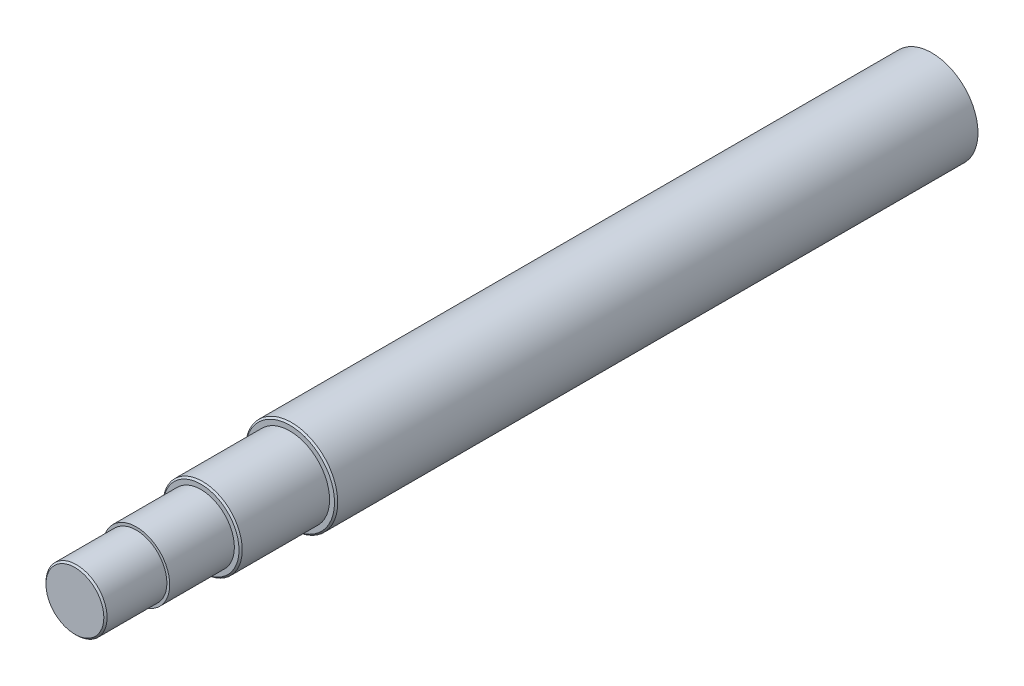
ISO-10303-21;
HEADER;
FILE_DESCRIPTION(('STEP AP214'),'2;1');
FILE_NAME('part.step','',(''),(''),'','','');
FILE_SCHEMA(('AUTOMOTIVE_DESIGN { 1 0 10303 214 1 1 1 1 }'));
ENDSEC;
DATA;
#1=APPLICATION_CONTEXT('core data for automotive mechanical design processes');
#2=APPLICATION_PROTOCOL_DEFINITION('international standard','automotive_design',2000,#1);
#3=PRODUCT_CONTEXT('',#1,'mechanical');
#4=PRODUCT('Part','Part','',(#3));
#5=PRODUCT_RELATED_PRODUCT_CATEGORY('part','',(#4));
#6=PRODUCT_DEFINITION_FORMATION('','',#4);
#7=PRODUCT_DEFINITION_CONTEXT('part definition',#1,'design');
#8=PRODUCT_DEFINITION('design','',#6,#7);
#9=PRODUCT_DEFINITION_SHAPE('','',#8);
#10=(LENGTH_UNIT() NAMED_UNIT(*) SI_UNIT(.MILLI.,.METRE.));
#11=(NAMED_UNIT(*) PLANE_ANGLE_UNIT() SI_UNIT($,.RADIAN.));
#12=(NAMED_UNIT(*) SI_UNIT($,.STERADIAN.) SOLID_ANGLE_UNIT());
#13=UNCERTAINTY_MEASURE_WITH_UNIT(LENGTH_MEASURE(1.E-05),#10,'distance_accuracy_value','');
#14=(GEOMETRIC_REPRESENTATION_CONTEXT(3) GLOBAL_UNCERTAINTY_ASSIGNED_CONTEXT((#13)) GLOBAL_UNIT_ASSIGNED_CONTEXT((#10,
#11,#12)) REPRESENTATION_CONTEXT('',''));
#15=CARTESIAN_POINT('',(0.,0.,0.));
#16=DIRECTION('',(0.,0.,1.));
#17=DIRECTION('',(1.,0.,0.));
#18=AXIS2_PLACEMENT_3D('',#15,#16,#17);
#19=CARTESIAN_POINT('',(0.,0.,452.));
#20=DIRECTION('',(0.,0.,1.));
#21=DIRECTION('',(1.,0.,0.));
#22=AXIS2_PLACEMENT_3D('',#19,#20,#21);
#23=PLANE('',#22);
#24=CARTESIAN_POINT('',(0.,0.,452.));
#25=DIRECTION('',(0.,0.,1.));
#26=DIRECTION('',(1.,0.,0.));
#27=AXIS2_PLACEMENT_3D('',#24,#25,#26);
#28=CIRCLE('',#27,23.5);
#29=CARTESIAN_POINT('',(23.5,0.,452.));
#30=VERTEX_POINT('',#29);
#31=EDGE_CURVE('E50',#30,#30,#28,.T.);
#32=ORIENTED_EDGE('',*,*,#31,.T.);
#33=EDGE_LOOP('',(#32));
#34=FACE_BOUND('',#33,.T.);
#35=CARTESIAN_POINT('',(0.,0.,452.));
#36=DIRECTION('',(0.,0.,1.));
#37=DIRECTION('',(1.,0.,0.));
#38=AXIS2_PLACEMENT_3D('',#35,#36,#37);
#39=CIRCLE('',#38,20.64);
#40=CARTESIAN_POINT('',(20.64,0.,452.));
#41=VERTEX_POINT('',#40);
#42=EDGE_CURVE('E68',#41,#41,#39,.T.);
#43=ORIENTED_EDGE('',*,*,#42,.F.);
#44=EDGE_LOOP('',(#43));
#45=FACE_BOUND('',#44,.T.);
#46=ADVANCED_FACE('F35',(#34,#45),#23,.T.);
#47=CARTESIAN_POINT('',(0.,0.,492.));
#48=DIRECTION('',(0.,0.,1.));
#49=DIRECTION('',(1.,0.,0.));
#50=AXIS2_PLACEMENT_3D('',#47,#48,#49);
#51=PLANE('',#50);
#52=CARTESIAN_POINT('',(0.,0.,492.));
#53=DIRECTION('',(0.,0.,1.));
#54=DIRECTION('',(1.,0.,0.));
#55=AXIS2_PLACEMENT_3D('',#52,#53,#54);
#56=CIRCLE('',#55,18.9);
#57=CARTESIAN_POINT('',(18.9,0.,492.));
#58=VERTEX_POINT('',#57);
#59=EDGE_CURVE('E65',#58,#58,#56,.T.);
#60=ORIENTED_EDGE('',*,*,#59,.F.);
#61=EDGE_LOOP('',(#60));
#62=FACE_BOUND('',#61,.T.);
#63=CARTESIAN_POINT('',(0.,0.,492.));
#64=DIRECTION('',(0.,0.,1.));
#65=DIRECTION('',(1.,0.,0.));
#66=AXIS2_PLACEMENT_3D('',#63,#64,#65);
#67=CIRCLE('',#66,20.64);
#68=CARTESIAN_POINT('',(20.64,0.,492.));
#69=VERTEX_POINT('',#68);
#70=EDGE_CURVE('E69',#69,#69,#67,.T.);
#71=ORIENTED_EDGE('',*,*,#70,.T.);
#72=EDGE_LOOP('',(#71));
#73=FACE_BOUND('',#72,.T.);
#74=ADVANCED_FACE('F106',(#62,#73),#51,.T.);
#75=CARTESIAN_POINT('',(0.,0.,492.));
#76=DIRECTION('',(0.,0.,1.));
#77=DIRECTION('',(1.,0.,0.));
#78=AXIS2_PLACEMENT_3D('',#75,#76,#77);
#79=CYLINDRICAL_SURFACE('',#78,18.9);
#80=CARTESIAN_POINT('',(0.,0.,529.));
#81=DIRECTION('',(0.,0.,1.));
#82=DIRECTION('',(1.,0.,0.));
#83=AXIS2_PLACEMENT_3D('',#80,#81,#82);
#84=CIRCLE('',#83,18.9);
#85=CARTESIAN_POINT('',(18.9,0.,529.));
#86=VERTEX_POINT('',#85);
#87=EDGE_CURVE('E11',#86,#86,#84,.F.);
#88=ORIENTED_EDGE('',*,*,#87,.T.);
#89=EDGE_LOOP('',(#88));
#90=FACE_BOUND('',#89,.T.);
#91=ORIENTED_EDGE('',*,*,#59,.T.);
#92=EDGE_LOOP('',(#91));
#93=FACE_BOUND('',#92,.T.);
#94=ADVANCED_FACE('F112',(#90,#93),#79,.T.);
#95=CARTESIAN_POINT('',(0.,0.,530.));
#96=DIRECTION('',(0.,0.,1.));
#97=DIRECTION('',(1.,0.,0.));
#98=AXIS2_PLACEMENT_3D('',#95,#96,#97);
#99=PLANE('',#98);
#100=CARTESIAN_POINT('',(0.,0.,530.));
#101=DIRECTION('',(0.,0.,1.));
#102=DIRECTION('',(1.,0.,0.));
#103=AXIS2_PLACEMENT_3D('',#100,#101,#102);
#104=CIRCLE('',#103,17.8999999999999);
#105=CARTESIAN_POINT('',(17.8999999999999,0.,530.));
#106=VERTEX_POINT('',#105);
#107=EDGE_CURVE('E42',#106,#106,#104,.T.);
#108=ORIENTED_EDGE('',*,*,#107,.T.);
#109=EDGE_LOOP('',(#108));
#110=FACE_BOUND('',#109,.T.);
#111=ADVANCED_FACE('F121',(#110),#99,.T.);
#112=CARTESIAN_POINT('',(0.,0.,452.));
#113=DIRECTION('',(0.,0.,1.));
#114=DIRECTION('',(1.,0.,0.));
#115=AXIS2_PLACEMENT_3D('',#112,#113,#114);
#116=CYLINDRICAL_SURFACE('',#115,20.64);
#117=ORIENTED_EDGE('',*,*,#42,.T.);
#118=EDGE_LOOP('',(#117));
#119=FACE_BOUND('',#118,.T.);
#120=ORIENTED_EDGE('',*,*,#70,.F.);
#121=EDGE_LOOP('',(#120));
#122=FACE_BOUND('',#121,.T.);
#123=ADVANCED_FACE('F118',(#119,#122),#116,.T.);
#124=CARTESIAN_POINT('',(0.,0.,397.));
#125=DIRECTION('',(0.,0.,1.));
#126=DIRECTION('',(1.,0.,0.));
#127=AXIS2_PLACEMENT_3D('',#124,#125,#126);
#128=PLANE('',#127);
#129=CARTESIAN_POINT('',(0.,0.,397.));
#130=DIRECTION('',(0.,0.,1.));
#131=DIRECTION('',(1.,0.,0.));
#132=AXIS2_PLACEMENT_3D('',#129,#130,#131);
#133=CIRCLE('',#132,27.5750000000001);
#134=CARTESIAN_POINT('',(27.5750000000001,0.,397.));
#135=VERTEX_POINT('',#134);
#136=EDGE_CURVE('E58',#135,#135,#133,.T.);
#137=ORIENTED_EDGE('',*,*,#136,.T.);
#138=EDGE_LOOP('',(#137));
#139=FACE_BOUND('',#138,.T.);
#140=CARTESIAN_POINT('',(0.,0.,397.));
#141=DIRECTION('',(0.,0.,1.));
#142=DIRECTION('',(1.,0.,0.));
#143=AXIS2_PLACEMENT_3D('',#140,#141,#142);
#144=CIRCLE('',#143,24.5);
#145=CARTESIAN_POINT('',(24.5,0.,397.));
#146=VERTEX_POINT('',#145);
#147=EDGE_CURVE('E72',#146,#146,#144,.T.);
#148=ORIENTED_EDGE('',*,*,#147,.F.);
#149=EDGE_LOOP('',(#148));
#150=FACE_BOUND('',#149,.T.);
#151=ADVANCED_FACE('F127',(#139,#150),#128,.T.);
#152=CARTESIAN_POINT('',(0.,0.,397.));
#153=DIRECTION('',(0.,0.,1.));
#154=DIRECTION('',(1.,0.,0.));
#155=AXIS2_PLACEMENT_3D('',#152,#153,#154);
#156=CYLINDRICAL_SURFACE('',#155,24.5);
#157=CARTESIAN_POINT('',(0.,0.,451.));
#158=DIRECTION('',(0.,0.,1.));
#159=DIRECTION('',(1.,0.,0.));
#160=AXIS2_PLACEMENT_3D('',#157,#158,#159);
#161=CIRCLE('',#160,24.5);
#162=CARTESIAN_POINT('',(24.5,0.,451.));
#163=VERTEX_POINT('',#162);
#164=EDGE_CURVE('E46',#163,#163,#161,.F.);
#165=ORIENTED_EDGE('',*,*,#164,.T.);
#166=EDGE_LOOP('',(#165));
#167=FACE_BOUND('',#166,.T.);
#168=ORIENTED_EDGE('',*,*,#147,.T.);
#169=EDGE_LOOP('',(#168));
#170=FACE_BOUND('',#169,.T.);
#171=ADVANCED_FACE('F95',(#167,#170),#156,.T.);
#172=CARTESIAN_POINT('',(0.,0.,0.));
#173=DIRECTION('',(0.,0.,1.));
#174=DIRECTION('',(1.,0.,0.));
#175=AXIS2_PLACEMENT_3D('',#172,#173,#174);
#176=PLANE('',#175);
#177=CARTESIAN_POINT('',(0.,0.,0.));
#178=DIRECTION('',(0.,0.,-1.));
#179=DIRECTION('',(-1.,0.,0.));
#180=AXIS2_PLACEMENT_3D('',#177,#178,#179);
#181=CIRCLE('',#180,5.);
#182=CARTESIAN_POINT('',(-5.,0.,0.));
#183=VERTEX_POINT('',#182);
#184=EDGE_CURVE('E61',#183,#183,#181,.T.);
#185=ORIENTED_EDGE('',*,*,#184,.F.);
#186=EDGE_LOOP('',(#185));
#187=FACE_BOUND('',#186,.T.);
#188=CARTESIAN_POINT('',(0.,0.,0.));
#189=DIRECTION('',(0.,0.,1.));
#190=DIRECTION('',(1.,0.,0.));
#191=AXIS2_PLACEMENT_3D('',#188,#189,#190);
#192=CIRCLE('',#191,28.575);
#193=CARTESIAN_POINT('',(28.575,0.,0.));
#194=VERTEX_POINT('',#193);
#195=EDGE_CURVE('E62',#194,#194,#192,.T.);
#196=ORIENTED_EDGE('',*,*,#195,.F.);
#197=EDGE_LOOP('',(#196));
#198=FACE_BOUND('',#197,.T.);
#199=ADVANCED_FACE('F92',(#187,#198),#176,.F.);
#200=CARTESIAN_POINT('',(0.,0.,530.));
#201=DIRECTION('',(0.,0.,-1.));
#202=DIRECTION('',(-1.,0.,0.));
#203=AXIS2_PLACEMENT_3D('',#200,#201,#202);
#204=CYLINDRICAL_SURFACE('',#203,28.575);
#205=CARTESIAN_POINT('',(0.,0.,396.));
#206=DIRECTION('',(0.,0.,1.));
#207=DIRECTION('',(1.,0.,0.));
#208=AXIS2_PLACEMENT_3D('',#205,#206,#207);
#209=CIRCLE('',#208,28.575);
#210=CARTESIAN_POINT('',(28.575,0.,396.));
#211=VERTEX_POINT('',#210);
#212=EDGE_CURVE('E55',#211,#211,#209,.F.);
#213=ORIENTED_EDGE('',*,*,#212,.T.);
#214=EDGE_LOOP('',(#213));
#215=FACE_BOUND('',#214,.T.);
#216=ORIENTED_EDGE('',*,*,#195,.T.);
#217=EDGE_LOOP('',(#216));
#218=FACE_BOUND('',#217,.T.);
#219=ADVANCED_FACE('F88',(#215,#218),#204,.T.);
#220=CARTESIAN_POINT('',(0.,0.,-5.));
#221=DIRECTION('',(0.,0.,1.));
#222=DIRECTION('',(1.,0.,0.));
#223=AXIS2_PLACEMENT_3D('',#220,#221,#222);
#224=CYLINDRICAL_SURFACE('',#223,5.);
#225=CARTESIAN_POINT('',(0.,0.,-5.));
#226=DIRECTION('',(0.,0.,-1.));
#227=DIRECTION('',(-1.,0.,0.));
#228=AXIS2_PLACEMENT_3D('',#225,#226,#227);
#229=CIRCLE('',#228,5.);
#230=CARTESIAN_POINT('',(-5.,0.,-5.));
#231=VERTEX_POINT('',#230);
#232=EDGE_CURVE('E77',#231,#231,#229,.T.);
#233=ORIENTED_EDGE('',*,*,#232,.F.);
#234=EDGE_LOOP('',(#233));
#235=FACE_BOUND('',#234,.T.);
#236=ORIENTED_EDGE('',*,*,#184,.T.);
#237=EDGE_LOOP('',(#236));
#238=FACE_BOUND('',#237,.T.);
#239=ADVANCED_FACE('F85',(#235,#238),#224,.T.);
#240=CARTESIAN_POINT('',(0.,0.,-5.));
#241=DIRECTION('',(0.,0.,-1.));
#242=DIRECTION('',(-1.,0.,0.));
#243=AXIS2_PLACEMENT_3D('',#240,#241,#242);
#244=PLANE('',#243);
#245=ORIENTED_EDGE('',*,*,#232,.T.);
#246=EDGE_LOOP('',(#245));
#247=FACE_BOUND('',#246,.T.);
#248=ADVANCED_FACE('F83',(#247),#244,.T.);
#249=CARTESIAN_POINT('',(0.,0.,397.));
#250=DIRECTION('',(0.,0.,-1.));
#251=DIRECTION('',(-1.,0.,0.));
#252=AXIS2_PLACEMENT_3D('',#249,#250,#251);
#253=CONICAL_SURFACE('',#252,27.5750000000001,0.785398163397414);
#254=ORIENTED_EDGE('',*,*,#212,.F.);
#255=EDGE_LOOP('',(#254));
#256=FACE_BOUND('',#255,.T.);
#257=ORIENTED_EDGE('',*,*,#136,.F.);
#258=EDGE_LOOP('',(#257));
#259=FACE_BOUND('',#258,.T.);
#260=ADVANCED_FACE('F145',(#256,#259),#253,.T.);
#261=CARTESIAN_POINT('',(0.,0.,452.));
#262=DIRECTION('',(0.,0.,-1.));
#263=DIRECTION('',(-1.,0.,0.));
#264=AXIS2_PLACEMENT_3D('',#261,#262,#263);
#265=CONICAL_SURFACE('',#264,23.5,0.785398163397438);
#266=ORIENTED_EDGE('',*,*,#164,.F.);
#267=EDGE_LOOP('',(#266));
#268=FACE_BOUND('',#267,.T.);
#269=ORIENTED_EDGE('',*,*,#31,.F.);
#270=EDGE_LOOP('',(#269));
#271=FACE_BOUND('',#270,.T.);
#272=ADVANCED_FACE('F149',(#268,#271),#265,.T.);
#273=CARTESIAN_POINT('',(0.,0.,530.));
#274=DIRECTION('',(0.,0.,-1.));
#275=DIRECTION('',(-1.,0.,0.));
#276=AXIS2_PLACEMENT_3D('',#273,#274,#275);
#277=CONICAL_SURFACE('',#276,17.8999999999999,0.78539816339749);
#278=ORIENTED_EDGE('',*,*,#87,.F.);
#279=EDGE_LOOP('',(#278));
#280=FACE_BOUND('',#279,.T.);
#281=ORIENTED_EDGE('',*,*,#107,.F.);
#282=EDGE_LOOP('',(#281));
#283=FACE_BOUND('',#282,.T.);
#284=ADVANCED_FACE('F37',(#280,#283),#277,.T.);
#285=CLOSED_SHELL('',(#46,#74,#94,#111,#123,#151,#171,#199,#219,#239,#248,#260,#272,#284));
#286=MANIFOLD_SOLID_BREP('B2',#285);
#287=ADVANCED_BREP_SHAPE_REPRESENTATION('',(#18,#286),#14);
#288=SHAPE_DEFINITION_REPRESENTATION(#9,#287);
ENDSEC;
END-ISO-10303-21;
